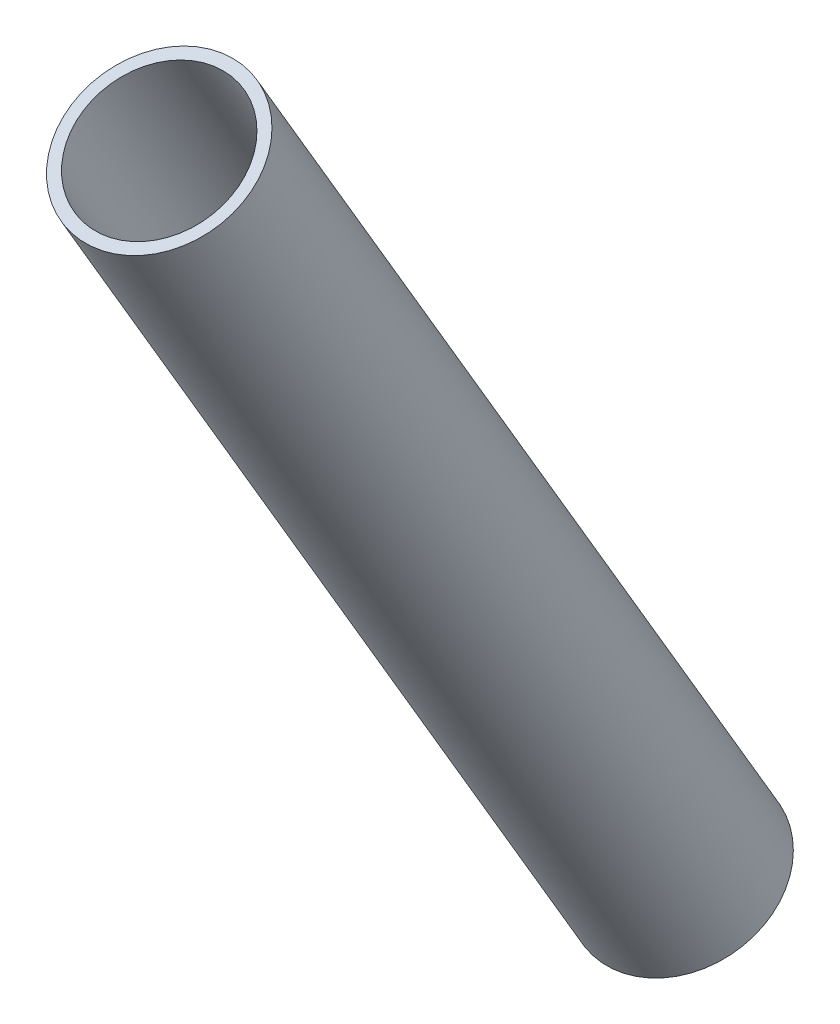
ISO-10303-21;
HEADER;
FILE_DESCRIPTION(('STEP AP214'),'2;1');
FILE_NAME('part.step','',(''),(''),'','','');
FILE_SCHEMA(('AUTOMOTIVE_DESIGN { 1 0 10303 214 1 1 1 1 }'));
ENDSEC;
DATA;
#1=APPLICATION_CONTEXT('core data for automotive mechanical design processes');
#2=APPLICATION_PROTOCOL_DEFINITION('international standard','automotive_design',2000,#1);
#3=PRODUCT_CONTEXT('',#1,'mechanical');
#4=PRODUCT('Part','Part','',(#3));
#5=PRODUCT_RELATED_PRODUCT_CATEGORY('part','',(#4));
#6=PRODUCT_DEFINITION_FORMATION('','',#4);
#7=PRODUCT_DEFINITION_CONTEXT('part definition',#1,'design');
#8=PRODUCT_DEFINITION('design','',#6,#7);
#9=PRODUCT_DEFINITION_SHAPE('','',#8);
#10=(LENGTH_UNIT() NAMED_UNIT(*) SI_UNIT(.MILLI.,.METRE.));
#11=(NAMED_UNIT(*) PLANE_ANGLE_UNIT() SI_UNIT($,.RADIAN.));
#12=(NAMED_UNIT(*) SI_UNIT($,.STERADIAN.) SOLID_ANGLE_UNIT());
#13=UNCERTAINTY_MEASURE_WITH_UNIT(LENGTH_MEASURE(1.E-05),#10,'distance_accuracy_value','');
#14=(GEOMETRIC_REPRESENTATION_CONTEXT(3) GLOBAL_UNCERTAINTY_ASSIGNED_CONTEXT((#13)) GLOBAL_UNIT_ASSIGNED_CONTEXT((#10,
#11,#12)) REPRESENTATION_CONTEXT('',''));
#15=CARTESIAN_POINT('',(0.,0.,0.));
#16=DIRECTION('',(0.,0.,1.));
#17=DIRECTION('',(1.,0.,0.));
#18=AXIS2_PLACEMENT_3D('',#15,#16,#17);
#19=CARTESIAN_POINT('',(0.,189.842593578162,111.662124714494));
#20=DIRECTION('',(0.,-0.861954035177848,-0.506986431022198));
#21=DIRECTION('',(0.,0.506986431022198,-0.861954035177848));
#22=AXIS2_PLACEMENT_3D('',#19,#20,#21);
#23=PLANE('',#22);
#24=CARTESIAN_POINT('',(0.,189.842593578162,111.662124714494));
#25=DIRECTION('',(0.,-0.861954035177848,-0.506986431022198));
#26=DIRECTION('',(0.,0.506986431022198,-0.861954035177848));
#27=AXIS2_PLACEMENT_3D('',#24,#25,#26);
#28=CIRCLE('',#27,14.9999999999998);
#29=CARTESIAN_POINT('',(0.,197.447390043495,98.7328141868262));
#30=VERTEX_POINT('',#29);
#31=EDGE_CURVE('E49',#30,#30,#28,.T.);
#32=ORIENTED_EDGE('',*,*,#31,.F.);
#33=EDGE_LOOP('',(#32));
#34=FACE_BOUND('',#33,.T.);
#35=CARTESIAN_POINT('',(0.,189.842593578162,111.662124714494));
#36=DIRECTION('',(0.,-0.861954035177848,-0.506986431022198));
#37=DIRECTION('',(0.,0.506986431022198,-0.861954035177848));
#38=AXIS2_PLACEMENT_3D('',#35,#36,#37);
#39=CIRCLE('',#38,12.9999999999998);
#40=CARTESIAN_POINT('',(0.,196.43341718145,100.456722257182));
#41=VERTEX_POINT('',#40);
#42=EDGE_CURVE('E10',#41,#41,#39,.T.);
#43=ORIENTED_EDGE('',*,*,#42,.T.);
#44=EDGE_LOOP('',(#43));
#45=FACE_BOUND('',#44,.T.);
#46=ADVANCED_FACE('F35',(#34,#45),#23,.F.);
#47=CARTESIAN_POINT('',(0.,0.,0.));
#48=DIRECTION('',(0.,-0.861954035177848,-0.506986431022198));
#49=DIRECTION('',(0.,0.506986431022198,-0.861954035177848));
#50=AXIS2_PLACEMENT_3D('',#47,#48,#49);
#51=CYLINDRICAL_SURFACE('',#50,12.9999999999999);
#52=CARTESIAN_POINT('',(0.,34.1944345252668,20.1125740042626));
#53=DIRECTION('',(0.,-0.861954035177848,-0.506986431022198));
#54=DIRECTION('',(0.,0.506986431022198,-0.861954035177848));
#55=AXIS2_PLACEMENT_3D('',#52,#53,#54);
#56=CIRCLE('',#55,13.);
#57=CARTESIAN_POINT('',(0.,40.7852581285554,8.90717154695055));
#58=VERTEX_POINT('',#57);
#59=EDGE_CURVE('E41',#58,#58,#56,.T.);
#60=ORIENTED_EDGE('',*,*,#59,.T.);
#61=EDGE_LOOP('',(#60));
#62=FACE_BOUND('',#61,.T.);
#63=ORIENTED_EDGE('',*,*,#42,.F.);
#64=EDGE_LOOP('',(#63));
#65=FACE_BOUND('',#64,.T.);
#66=ADVANCED_FACE('F58',(#62,#65),#51,.F.);
#67=CARTESIAN_POINT('',(0.,34.1944345252667,20.1125740042627));
#68=DIRECTION('',(0.,0.861954035177848,0.506986431022198));
#69=DIRECTION('',(0.,-0.506986431022198,0.861954035177848));
#70=AXIS2_PLACEMENT_3D('',#67,#68,#69);
#71=PLANE('',#70);
#72=ORIENTED_EDGE('',*,*,#59,.F.);
#73=EDGE_LOOP('',(#72));
#74=FACE_BOUND('',#73,.T.);
#75=CARTESIAN_POINT('',(0.,34.1944345252668,20.1125740042626));
#76=DIRECTION('',(0.,-0.861954035177848,-0.506986431022198));
#77=DIRECTION('',(0.,0.506986431022198,-0.861954035177848));
#78=AXIS2_PLACEMENT_3D('',#75,#76,#77);
#79=CIRCLE('',#78,14.9999999999999);
#80=CARTESIAN_POINT('',(0.,41.7992309905997,7.18326347659495));
#81=VERTEX_POINT('',#80);
#82=EDGE_CURVE('E45',#81,#81,#79,.T.);
#83=ORIENTED_EDGE('',*,*,#82,.T.);
#84=EDGE_LOOP('',(#83));
#85=FACE_BOUND('',#84,.T.);
#86=ADVANCED_FACE('F62',(#74,#85),#71,.F.);
#87=CARTESIAN_POINT('',(0.,0.,0.));
#88=DIRECTION('',(0.,-0.861954035177848,-0.506986431022198));
#89=DIRECTION('',(0.,0.506986431022198,-0.861954035177848));
#90=AXIS2_PLACEMENT_3D('',#87,#88,#89);
#91=CYLINDRICAL_SURFACE('',#90,14.9999999999999);
#92=ORIENTED_EDGE('',*,*,#82,.F.);
#93=EDGE_LOOP('',(#92));
#94=FACE_BOUND('',#93,.T.);
#95=ORIENTED_EDGE('',*,*,#31,.T.);
#96=EDGE_LOOP('',(#95));
#97=FACE_BOUND('',#96,.T.);
#98=ADVANCED_FACE('F55',(#94,#97),#91,.T.);
#99=CLOSED_SHELL('',(#46,#66,#86,#98));
#100=MANIFOLD_SOLID_BREP('B2',#99);
#101=ADVANCED_BREP_SHAPE_REPRESENTATION('',(#18,#100),#14);
#102=SHAPE_DEFINITION_REPRESENTATION(#9,#101);
ENDSEC;
END-ISO-10303-21;
